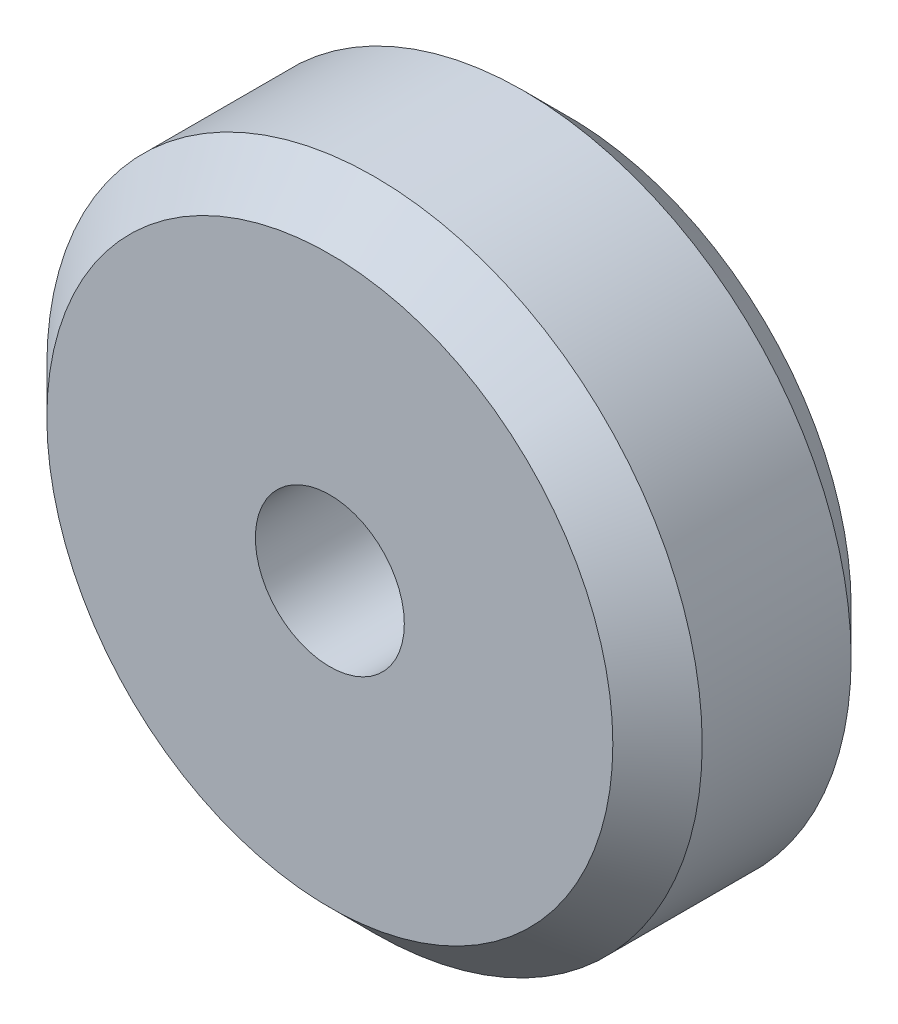
ISO-10303-21;
HEADER;
FILE_DESCRIPTION(('STEP AP214'),'2;1');
FILE_NAME('part.step','',(''),(''),'','','');
FILE_SCHEMA(('AUTOMOTIVE_DESIGN { 1 0 10303 214 1 1 1 1 }'));
ENDSEC;
DATA;
#1=APPLICATION_CONTEXT('core data for automotive mechanical design processes');
#2=APPLICATION_PROTOCOL_DEFINITION('international standard','automotive_design',2000,#1);
#3=PRODUCT_CONTEXT('',#1,'mechanical');
#4=PRODUCT('Part','Part','',(#3));
#5=PRODUCT_RELATED_PRODUCT_CATEGORY('part','',(#4));
#6=PRODUCT_DEFINITION_FORMATION('','',#4);
#7=PRODUCT_DEFINITION_CONTEXT('part definition',#1,'design');
#8=PRODUCT_DEFINITION('design','',#6,#7);
#9=PRODUCT_DEFINITION_SHAPE('','',#8);
#10=(LENGTH_UNIT() NAMED_UNIT(*) SI_UNIT(.MILLI.,.METRE.));
#11=(NAMED_UNIT(*) PLANE_ANGLE_UNIT() SI_UNIT($,.RADIAN.));
#12=(NAMED_UNIT(*) SI_UNIT($,.STERADIAN.) SOLID_ANGLE_UNIT());
#13=UNCERTAINTY_MEASURE_WITH_UNIT(LENGTH_MEASURE(1.E-05),#10,'distance_accuracy_value','');
#14=(GEOMETRIC_REPRESENTATION_CONTEXT(3) GLOBAL_UNCERTAINTY_ASSIGNED_CONTEXT((#13)) GLOBAL_UNIT_ASSIGNED_CONTEXT((#10,
#11,#12)) REPRESENTATION_CONTEXT('',''));
#15=CARTESIAN_POINT('',(0.,0.,0.));
#16=DIRECTION('',(0.,0.,1.));
#17=DIRECTION('',(1.,0.,0.));
#18=AXIS2_PLACEMENT_3D('',#15,#16,#17);
#19=CARTESIAN_POINT('',(0.,0.,4.));
#20=DIRECTION('',(0.,0.,1.));
#21=DIRECTION('',(1.,0.,0.));
#22=AXIS2_PLACEMENT_3D('',#19,#20,#21);
#23=PLANE('',#22);
#24=CARTESIAN_POINT('',(0.,0.,4.));
#25=DIRECTION('',(0.,0.,1.));
#26=DIRECTION('',(1.,0.,0.));
#27=AXIS2_PLACEMENT_3D('',#24,#25,#26);
#28=CIRCLE('',#27,9.50000000000001);
#29=CARTESIAN_POINT('',(9.50000000000001,0.,4.));
#30=VERTEX_POINT('',#29);
#31=EDGE_CURVE('E10',#30,#30,#28,.T.);
#32=ORIENTED_EDGE('',*,*,#31,.T.);
#33=EDGE_LOOP('',(#32));
#34=FACE_BOUND('',#33,.T.);
#35=CARTESIAN_POINT('',(0.,0.,4.));
#36=DIRECTION('',(0.,0.,1.));
#37=DIRECTION('',(1.,0.,0.));
#38=AXIS2_PLACEMENT_3D('',#35,#36,#37);
#39=CIRCLE('',#38,2.5);
#40=CARTESIAN_POINT('',(2.5,0.,4.));
#41=VERTEX_POINT('',#40);
#42=EDGE_CURVE('E58',#41,#41,#39,.T.);
#43=ORIENTED_EDGE('',*,*,#42,.F.);
#44=EDGE_LOOP('',(#43));
#45=FACE_BOUND('',#44,.T.);
#46=ADVANCED_FACE('F37',(#34,#45),#23,.T.);
#47=CARTESIAN_POINT('',(0.,0.,-4.));
#48=DIRECTION('',(0.,0.,1.));
#49=DIRECTION('',(1.,0.,0.));
#50=AXIS2_PLACEMENT_3D('',#47,#48,#49);
#51=PLANE('',#50);
#52=CARTESIAN_POINT('',(0.,0.,-4.));
#53=DIRECTION('',(0.,0.,1.));
#54=DIRECTION('',(1.,0.,0.));
#55=AXIS2_PLACEMENT_3D('',#52,#53,#54);
#56=CIRCLE('',#55,9.49999999999999);
#57=CARTESIAN_POINT('',(9.49999999999999,0.,-4.));
#58=VERTEX_POINT('',#57);
#59=EDGE_CURVE('E45',#58,#58,#56,.F.);
#60=ORIENTED_EDGE('',*,*,#59,.T.);
#61=EDGE_LOOP('',(#60));
#62=FACE_BOUND('',#61,.T.);
#63=CARTESIAN_POINT('',(0.,0.,-4.));
#64=DIRECTION('',(0.,0.,1.));
#65=DIRECTION('',(1.,0.,0.));
#66=AXIS2_PLACEMENT_3D('',#63,#64,#65);
#67=CIRCLE('',#66,2.5);
#68=CARTESIAN_POINT('',(2.5,0.,-4.));
#69=VERTEX_POINT('',#68);
#70=EDGE_CURVE('E59',#69,#69,#67,.T.);
#71=ORIENTED_EDGE('',*,*,#70,.T.);
#72=EDGE_LOOP('',(#71));
#73=FACE_BOUND('',#72,.T.);
#74=ADVANCED_FACE('F69',(#62,#73),#51,.F.);
#75=CARTESIAN_POINT('',(0.,0.,4.));
#76=DIRECTION('',(0.,0.,-1.));
#77=DIRECTION('',(-1.,0.,0.));
#78=AXIS2_PLACEMENT_3D('',#75,#76,#77);
#79=CYLINDRICAL_SURFACE('',#78,11.);
#80=CARTESIAN_POINT('',(0.,0.,-2.5));
#81=DIRECTION('',(0.,0.,1.));
#82=DIRECTION('',(1.,0.,0.));
#83=AXIS2_PLACEMENT_3D('',#80,#81,#82);
#84=CIRCLE('',#83,11.);
#85=CARTESIAN_POINT('',(11.,0.,-2.5));
#86=VERTEX_POINT('',#85);
#87=EDGE_CURVE('E49',#86,#86,#84,.T.);
#88=ORIENTED_EDGE('',*,*,#87,.T.);
#89=EDGE_LOOP('',(#88));
#90=FACE_BOUND('',#89,.T.);
#91=CARTESIAN_POINT('',(0.,0.,2.5));
#92=DIRECTION('',(0.,0.,1.));
#93=DIRECTION('',(1.,0.,0.));
#94=AXIS2_PLACEMENT_3D('',#91,#92,#93);
#95=CIRCLE('',#94,11.);
#96=CARTESIAN_POINT('',(11.,0.,2.5));
#97=VERTEX_POINT('',#96);
#98=EDGE_CURVE('E53',#97,#97,#95,.F.);
#99=ORIENTED_EDGE('',*,*,#98,.T.);
#100=EDGE_LOOP('',(#99));
#101=FACE_BOUND('',#100,.T.);
#102=ADVANCED_FACE('F74',(#90,#101),#79,.T.);
#103=CARTESIAN_POINT('',(0.,0.,4.));
#104=DIRECTION('',(0.,0.,-1.));
#105=DIRECTION('',(-1.,0.,0.));
#106=AXIS2_PLACEMENT_3D('',#103,#104,#105);
#107=CYLINDRICAL_SURFACE('',#106,2.5);
#108=ORIENTED_EDGE('',*,*,#42,.T.);
#109=EDGE_LOOP('',(#108));
#110=FACE_BOUND('',#109,.T.);
#111=ORIENTED_EDGE('',*,*,#70,.F.);
#112=EDGE_LOOP('',(#111));
#113=FACE_BOUND('',#112,.T.);
#114=ADVANCED_FACE('F65',(#110,#113),#107,.F.);
#115=CARTESIAN_POINT('',(0.,0.,-2.5));
#116=DIRECTION('',(0.,0.,1.));
#117=DIRECTION('',(1.,0.,0.));
#118=AXIS2_PLACEMENT_3D('',#115,#116,#117);
#119=CONICAL_SURFACE('',#118,11.,0.785398163397451);
#120=ORIENTED_EDGE('',*,*,#59,.F.);
#121=EDGE_LOOP('',(#120));
#122=FACE_BOUND('',#121,.T.);
#123=ORIENTED_EDGE('',*,*,#87,.F.);
#124=EDGE_LOOP('',(#123));
#125=FACE_BOUND('',#124,.T.);
#126=ADVANCED_FACE('F81',(#122,#125),#119,.T.);
#127=CARTESIAN_POINT('',(0.,0.,4.));
#128=DIRECTION('',(0.,0.,-1.));
#129=DIRECTION('',(-1.,0.,0.));
#130=AXIS2_PLACEMENT_3D('',#127,#128,#129);
#131=CONICAL_SURFACE('',#130,9.50000000000001,0.785398163397447);
#132=ORIENTED_EDGE('',*,*,#98,.F.);
#133=EDGE_LOOP('',(#132));
#134=FACE_BOUND('',#133,.T.);
#135=ORIENTED_EDGE('',*,*,#31,.F.);
#136=EDGE_LOOP('',(#135));
#137=FACE_BOUND('',#136,.T.);
#138=ADVANCED_FACE('F40',(#134,#137),#131,.T.);
#139=CLOSED_SHELL('',(#46,#74,#102,#114,#126,#138));
#140=MANIFOLD_SOLID_BREP('B2',#139);
#141=ADVANCED_BREP_SHAPE_REPRESENTATION('',(#18,#140),#14);
#142=SHAPE_DEFINITION_REPRESENTATION(#9,#141);
ENDSEC;
END-ISO-10303-21;
